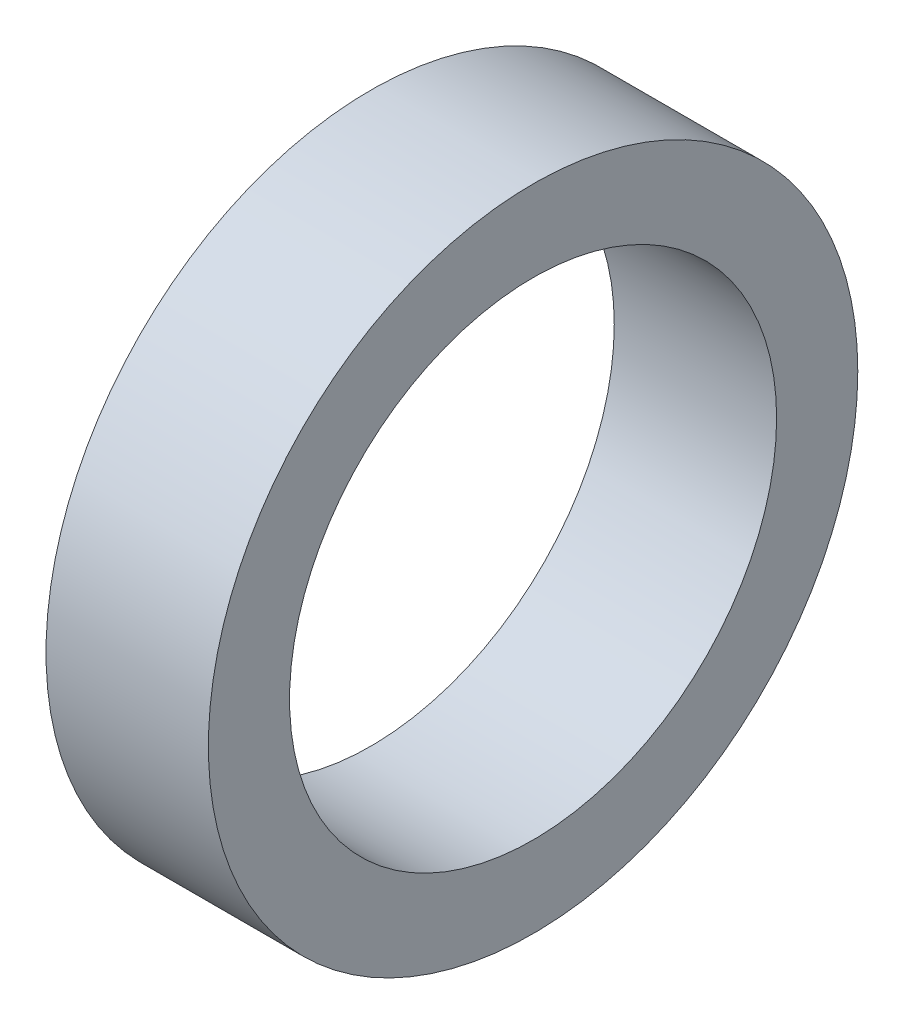
ISO-10303-21;
HEADER;
FILE_DESCRIPTION(('STEP AP214'),'2;1');
FILE_NAME('part.step','',(''),(''),'','','');
FILE_SCHEMA(('AUTOMOTIVE_DESIGN { 1 0 10303 214 1 1 1 1 }'));
ENDSEC;
DATA;
#1=APPLICATION_CONTEXT('core data for automotive mechanical design processes');
#2=APPLICATION_PROTOCOL_DEFINITION('international standard','automotive_design',2000,#1);
#3=PRODUCT_CONTEXT('',#1,'mechanical');
#4=PRODUCT('Part','Part','',(#3));
#5=PRODUCT_RELATED_PRODUCT_CATEGORY('part','',(#4));
#6=PRODUCT_DEFINITION_FORMATION('','',#4);
#7=PRODUCT_DEFINITION_CONTEXT('part definition',#1,'design');
#8=PRODUCT_DEFINITION('design','',#6,#7);
#9=PRODUCT_DEFINITION_SHAPE('','',#8);
#10=(LENGTH_UNIT() NAMED_UNIT(*) SI_UNIT(.MILLI.,.METRE.));
#11=(NAMED_UNIT(*) PLANE_ANGLE_UNIT() SI_UNIT($,.RADIAN.));
#12=(NAMED_UNIT(*) SI_UNIT($,.STERADIAN.) SOLID_ANGLE_UNIT());
#13=UNCERTAINTY_MEASURE_WITH_UNIT(LENGTH_MEASURE(1.E-05),#10,'distance_accuracy_value','');
#14=(GEOMETRIC_REPRESENTATION_CONTEXT(3) GLOBAL_UNCERTAINTY_ASSIGNED_CONTEXT((#13)) GLOBAL_UNIT_ASSIGNED_CONTEXT((#10,
#11,#12)) REPRESENTATION_CONTEXT('',''));
#15=CARTESIAN_POINT('',(0.,0.,0.));
#16=DIRECTION('',(0.,0.,1.));
#17=DIRECTION('',(1.,0.,0.));
#18=AXIS2_PLACEMENT_3D('',#15,#16,#17);
#19=CARTESIAN_POINT('',(3.175,0.,0.));
#20=DIRECTION('',(1.,0.,0.));
#21=DIRECTION('',(0.,0.,-1.));
#22=AXIS2_PLACEMENT_3D('',#19,#20,#21);
#23=PLANE('',#22);
#24=CARTESIAN_POINT('',(3.175,0.,0.));
#25=DIRECTION('',(1.,0.,0.));
#26=DIRECTION('',(0.,0.,-1.));
#27=AXIS2_PLACEMENT_3D('',#24,#25,#26);
#28=CIRCLE('',#27,12.7);
#29=CARTESIAN_POINT('',(3.175,0.,-12.7));
#30=VERTEX_POINT('',#29);
#31=EDGE_CURVE('E10',#30,#30,#28,.T.);
#32=ORIENTED_EDGE('',*,*,#31,.T.);
#33=EDGE_LOOP('',(#32));
#34=FACE_BOUND('',#33,.T.);
#35=CARTESIAN_POINT('',(3.175,0.,0.));
#36=DIRECTION('',(1.,0.,0.));
#37=DIRECTION('',(0.,0.,-1.));
#38=AXIS2_PLACEMENT_3D('',#35,#36,#37);
#39=CIRCLE('',#38,9.525);
#40=CARTESIAN_POINT('',(3.175,0.,-9.525));
#41=VERTEX_POINT('',#40);
#42=EDGE_CURVE('E46',#41,#41,#39,.T.);
#43=ORIENTED_EDGE('',*,*,#42,.F.);
#44=EDGE_LOOP('',(#43));
#45=FACE_BOUND('',#44,.T.);
#46=ADVANCED_FACE('F35',(#34,#45),#23,.T.);
#47=CARTESIAN_POINT('',(-3.175,0.,0.));
#48=DIRECTION('',(1.,0.,0.));
#49=DIRECTION('',(0.,0.,-1.));
#50=AXIS2_PLACEMENT_3D('',#47,#48,#49);
#51=PLANE('',#50);
#52=CARTESIAN_POINT('',(-3.175,0.,0.));
#53=DIRECTION('',(1.,0.,0.));
#54=DIRECTION('',(0.,0.,-1.));
#55=AXIS2_PLACEMENT_3D('',#52,#53,#54);
#56=CIRCLE('',#55,12.7);
#57=CARTESIAN_POINT('',(-3.175,0.,-12.7));
#58=VERTEX_POINT('',#57);
#59=EDGE_CURVE('E39',#58,#58,#56,.T.);
#60=ORIENTED_EDGE('',*,*,#59,.F.);
#61=EDGE_LOOP('',(#60));
#62=FACE_BOUND('',#61,.T.);
#63=CARTESIAN_POINT('',(-3.175,0.,0.));
#64=DIRECTION('',(1.,0.,0.));
#65=DIRECTION('',(0.,0.,-1.));
#66=AXIS2_PLACEMENT_3D('',#63,#64,#65);
#67=CIRCLE('',#66,9.525);
#68=CARTESIAN_POINT('',(-3.175,0.,-9.525));
#69=VERTEX_POINT('',#68);
#70=EDGE_CURVE('E48',#69,#69,#67,.T.);
#71=ORIENTED_EDGE('',*,*,#70,.T.);
#72=EDGE_LOOP('',(#71));
#73=FACE_BOUND('',#72,.T.);
#74=ADVANCED_FACE('F58',(#62,#73),#51,.F.);
#75=CARTESIAN_POINT('',(3.175,0.,0.));
#76=DIRECTION('',(-1.,0.,0.));
#77=DIRECTION('',(0.,0.,1.));
#78=AXIS2_PLACEMENT_3D('',#75,#76,#77);
#79=CYLINDRICAL_SURFACE('',#78,12.7);
#80=ORIENTED_EDGE('',*,*,#31,.F.);
#81=EDGE_LOOP('',(#80));
#82=FACE_BOUND('',#81,.T.);
#83=ORIENTED_EDGE('',*,*,#59,.T.);
#84=EDGE_LOOP('',(#83));
#85=FACE_BOUND('',#84,.T.);
#86=ADVANCED_FACE('F37',(#82,#85),#79,.T.);
#87=CARTESIAN_POINT('',(3.175,0.,0.));
#88=DIRECTION('',(-1.,0.,0.));
#89=DIRECTION('',(0.,0.,1.));
#90=AXIS2_PLACEMENT_3D('',#87,#88,#89);
#91=CYLINDRICAL_SURFACE('',#90,9.525);
#92=ORIENTED_EDGE('',*,*,#42,.T.);
#93=EDGE_LOOP('',(#92));
#94=FACE_BOUND('',#93,.T.);
#95=ORIENTED_EDGE('',*,*,#70,.F.);
#96=EDGE_LOOP('',(#95));
#97=FACE_BOUND('',#96,.T.);
#98=ADVANCED_FACE('F54',(#94,#97),#91,.F.);
#99=CLOSED_SHELL('',(#46,#74,#86,#98));
#100=MANIFOLD_SOLID_BREP('B2',#99);
#101=ADVANCED_BREP_SHAPE_REPRESENTATION('',(#18,#100),#14);
#102=SHAPE_DEFINITION_REPRESENTATION(#9,#101);
ENDSEC;
END-ISO-10303-21;
